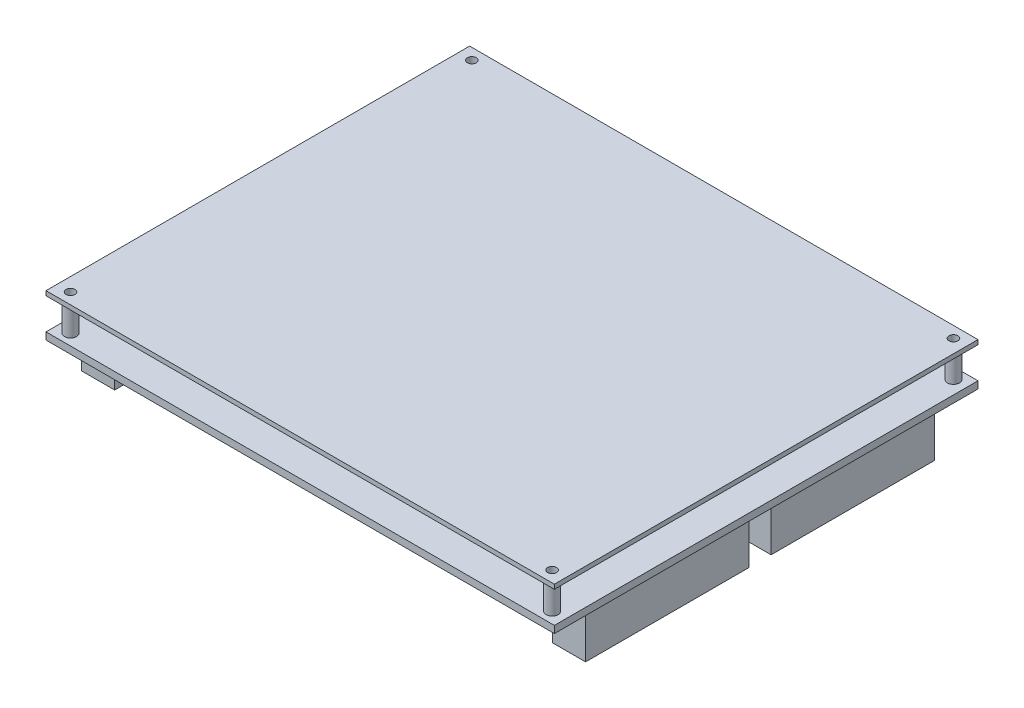
ISO-10303-21;
HEADER;
FILE_DESCRIPTION(('STEP AP214'),'2;1');
FILE_NAME('part.step','',(''),(''),'','','');
FILE_SCHEMA(('AUTOMOTIVE_DESIGN { 1 0 10303 214 1 1 1 1 }'));
ENDSEC;
DATA;
#1=APPLICATION_CONTEXT('core data for automotive mechanical design processes');
#2=APPLICATION_PROTOCOL_DEFINITION('international standard','automotive_design',2000,#1);
#3=PRODUCT_CONTEXT('',#1,'mechanical');
#4=PRODUCT('Part','Part','',(#3));
#5=PRODUCT_RELATED_PRODUCT_CATEGORY('part','',(#4));
#6=PRODUCT_DEFINITION_FORMATION('','',#4);
#7=PRODUCT_DEFINITION_CONTEXT('part definition',#1,'design');
#8=PRODUCT_DEFINITION('design','',#6,#7);
#9=PRODUCT_DEFINITION_SHAPE('','',#8);
#10=(LENGTH_UNIT() NAMED_UNIT(*) SI_UNIT(.MILLI.,.METRE.));
#11=(NAMED_UNIT(*) PLANE_ANGLE_UNIT() SI_UNIT($,.RADIAN.));
#12=(NAMED_UNIT(*) SI_UNIT($,.STERADIAN.) SOLID_ANGLE_UNIT());
#13=UNCERTAINTY_MEASURE_WITH_UNIT(LENGTH_MEASURE(1.E-05),#10,'distance_accuracy_value','');
#14=(GEOMETRIC_REPRESENTATION_CONTEXT(3) GLOBAL_UNCERTAINTY_ASSIGNED_CONTEXT((#13)) GLOBAL_UNIT_ASSIGNED_CONTEXT((#10,
#11,#12)) REPRESENTATION_CONTEXT('',''));
#15=CARTESIAN_POINT('',(0.,0.,0.));
#16=DIRECTION('',(0.,0.,1.));
#17=DIRECTION('',(1.,0.,0.));
#18=AXIS2_PLACEMENT_3D('',#15,#16,#17);
#19=CARTESIAN_POINT('',(-57.,1.6,47.5));
#20=DIRECTION('',(0.,1.,0.));
#21=DIRECTION('',(0.,0.,1.));
#22=AXIS2_PLACEMENT_3D('',#19,#20,#21);
#23=PLANE('',#22);
#24=CARTESIAN_POINT('',(54.,1.6,45.));
#25=DIRECTION('',(0.,1.,0.));
#26=DIRECTION('',(0.,0.,1.));
#27=AXIS2_PLACEMENT_3D('',#24,#25,#26);
#28=CIRCLE('',#27,1.35);
#29=CARTESIAN_POINT('',(54.,1.6,46.35));
#30=VERTEX_POINT('',#29);
#31=EDGE_CURVE('E246',#30,#30,#28,.T.);
#32=ORIENTED_EDGE('',*,*,#31,.F.);
#33=EDGE_LOOP('',(#32));
#34=FACE_BOUND('',#33,.T.);
#35=CARTESIAN_POINT('',(-54.,1.6,-45.));
#36=DIRECTION('',(0.,1.,0.));
#37=DIRECTION('',(0.,0.,1.));
#38=AXIS2_PLACEMENT_3D('',#35,#36,#37);
#39=CIRCLE('',#38,1.35);
#40=CARTESIAN_POINT('',(-54.,1.6,-43.65));
#41=VERTEX_POINT('',#40);
#42=EDGE_CURVE('E258',#41,#41,#39,.T.);
#43=ORIENTED_EDGE('',*,*,#42,.F.);
#44=EDGE_LOOP('',(#43));
#45=FACE_BOUND('',#44,.T.);
#46=DIRECTION('',(0.,0.,1.));
#47=VECTOR('',#46,1.);
#48=CARTESIAN_POINT('',(-57.,1.6,-47.5));
#49=LINE('',#48,#47);
#50=CARTESIAN_POINT('',(-57.,1.6,-47.5));
#51=VERTEX_POINT('',#50);
#52=CARTESIAN_POINT('',(-57.,1.6,47.5));
#53=VERTEX_POINT('',#52);
#54=EDGE_CURVE('E400',#51,#53,#49,.T.);
#55=ORIENTED_EDGE('',*,*,#54,.T.);
#56=DIRECTION('',(1.,0.,0.));
#57=VECTOR('',#56,1.);
#58=CARTESIAN_POINT('',(-57.,1.6,47.5));
#59=LINE('',#58,#57);
#60=CARTESIAN_POINT('',(57.,1.6,47.5));
#61=VERTEX_POINT('',#60);
#62=EDGE_CURVE('E403',#53,#61,#59,.T.);
#63=ORIENTED_EDGE('',*,*,#62,.T.);
#64=DIRECTION('',(0.,0.,-1.));
#65=VECTOR('',#64,1.);
#66=CARTESIAN_POINT('',(57.,1.6,-47.5));
#67=LINE('',#66,#65);
#68=CARTESIAN_POINT('',(57.,1.6,-47.5));
#69=VERTEX_POINT('',#68);
#70=EDGE_CURVE('E405',#61,#69,#67,.T.);
#71=ORIENTED_EDGE('',*,*,#70,.T.);
#72=DIRECTION('',(-1.,0.,0.));
#73=VECTOR('',#72,1.);
#74=CARTESIAN_POINT('',(-57.,1.6,-47.5));
#75=LINE('',#74,#73);
#76=EDGE_CURVE('E407',#69,#51,#75,.T.);
#77=ORIENTED_EDGE('',*,*,#76,.T.);
#78=EDGE_LOOP('',(#55,#63,#71,#77));
#79=FACE_BOUND('',#78,.T.);
#80=CARTESIAN_POINT('',(-54.,1.6,45.));
#81=DIRECTION('',(0.,1.,0.));
#82=DIRECTION('',(0.,0.,1.));
#83=AXIS2_PLACEMENT_3D('',#80,#81,#82);
#84=CIRCLE('',#83,1.35000000000001);
#85=CARTESIAN_POINT('',(-54.,1.6,46.35));
#86=VERTEX_POINT('',#85);
#87=EDGE_CURVE('E252',#86,#86,#84,.T.);
#88=ORIENTED_EDGE('',*,*,#87,.F.);
#89=EDGE_LOOP('',(#88));
#90=FACE_BOUND('',#89,.T.);
#91=CARTESIAN_POINT('',(54.,1.6,-45.));
#92=DIRECTION('',(0.,1.,0.));
#93=DIRECTION('',(0.,0.,1.));
#94=AXIS2_PLACEMENT_3D('',#91,#92,#93);
#95=CIRCLE('',#94,1.35000000000001);
#96=CARTESIAN_POINT('',(54.,1.6,-43.65));
#97=VERTEX_POINT('',#96);
#98=EDGE_CURVE('E212',#97,#97,#95,.T.);
#99=ORIENTED_EDGE('',*,*,#98,.F.);
#100=EDGE_LOOP('',(#99));
#101=FACE_BOUND('',#100,.T.);
#102=ADVANCED_FACE('F34',(#34,#45,#79,#90,#101),#23,.T.);
#103=CARTESIAN_POINT('',(-57.,0.,47.5));
#104=DIRECTION('',(0.,1.,0.));
#105=DIRECTION('',(0.,0.,1.));
#106=AXIS2_PLACEMENT_3D('',#103,#104,#105);
#107=PLANE('',#106);
#108=CARTESIAN_POINT('',(54.,0.,-45.));
#109=DIRECTION('',(0.,1.,0.));
#110=DIRECTION('',(0.,0.,1.));
#111=AXIS2_PLACEMENT_3D('',#108,#109,#110);
#112=CIRCLE('',#111,0.999999999999998);
#113=CARTESIAN_POINT('',(54.,0.,-44.));
#114=VERTEX_POINT('',#113);
#115=EDGE_CURVE('E598',#114,#114,#112,.T.);
#116=ORIENTED_EDGE('',*,*,#115,.T.);
#117=EDGE_LOOP('',(#116));
#118=FACE_BOUND('',#117,.T.);
#119=CARTESIAN_POINT('',(54.,0.,45.));
#120=DIRECTION('',(0.,1.,0.));
#121=DIRECTION('',(0.,0.,1.));
#122=AXIS2_PLACEMENT_3D('',#119,#120,#121);
#123=CIRCLE('',#122,0.999999999999998);
#124=CARTESIAN_POINT('',(54.,0.,46.));
#125=VERTEX_POINT('',#124);
#126=EDGE_CURVE('E602',#125,#125,#123,.T.);
#127=ORIENTED_EDGE('',*,*,#126,.T.);
#128=EDGE_LOOP('',(#127));
#129=FACE_BOUND('',#128,.T.);
#130=CARTESIAN_POINT('',(-54.,0.,45.));
#131=DIRECTION('',(0.,1.,0.));
#132=DIRECTION('',(0.,0.,1.));
#133=AXIS2_PLACEMENT_3D('',#130,#131,#132);
#134=CIRCLE('',#133,0.999999999999998);
#135=CARTESIAN_POINT('',(-54.,0.,46.));
#136=VERTEX_POINT('',#135);
#137=EDGE_CURVE('E611',#136,#136,#134,.T.);
#138=ORIENTED_EDGE('',*,*,#137,.T.);
#139=EDGE_LOOP('',(#138));
#140=FACE_BOUND('',#139,.T.);
#141=CARTESIAN_POINT('',(-54.,0.,-45.));
#142=DIRECTION('',(0.,1.,0.));
#143=DIRECTION('',(0.,0.,1.));
#144=AXIS2_PLACEMENT_3D('',#141,#142,#143);
#145=CIRCLE('',#144,0.999999999999998);
#146=CARTESIAN_POINT('',(-54.,0.,-44.));
#147=VERTEX_POINT('',#146);
#148=EDGE_CURVE('E219',#147,#147,#145,.T.);
#149=ORIENTED_EDGE('',*,*,#148,.T.);
#150=EDGE_LOOP('',(#149));
#151=FACE_BOUND('',#150,.T.);
#152=DIRECTION('',(0.,0.,-1.));
#153=VECTOR('',#152,1.);
#154=CARTESIAN_POINT('',(49.1,0.,40.));
#155=LINE('',#154,#153);
#156=CARTESIAN_POINT('',(49.1,0.,40.));
#157=VERTEX_POINT('',#156);
#158=CARTESIAN_POINT('',(49.1,0.,3.4));
#159=VERTEX_POINT('',#158);
#160=EDGE_CURVE('E292',#157,#159,#155,.T.);
#161=ORIENTED_EDGE('',*,*,#160,.F.);
#162=DIRECTION('',(-1.,0.,0.));
#163=VECTOR('',#162,1.);
#164=CARTESIAN_POINT('',(49.1,0.,40.));
#165=LINE('',#164,#163);
#166=CARTESIAN_POINT('',(56.5,0.,40.));
#167=VERTEX_POINT('',#166);
#168=EDGE_CURVE('E301',#167,#157,#165,.T.);
#169=ORIENTED_EDGE('',*,*,#168,.F.);
#170=DIRECTION('',(0.,0.,1.));
#171=VECTOR('',#170,1.);
#172=CARTESIAN_POINT('',(56.5,0.,40.));
#173=LINE('',#172,#171);
#174=CARTESIAN_POINT('',(56.5,0.,3.4));
#175=VERTEX_POINT('',#174);
#176=EDGE_CURVE('E298',#175,#167,#173,.T.);
#177=ORIENTED_EDGE('',*,*,#176,.F.);
#178=DIRECTION('',(1.,0.,0.));
#179=VECTOR('',#178,1.);
#180=CARTESIAN_POINT('',(49.1,0.,3.4));
#181=LINE('',#180,#179);
#182=EDGE_CURVE('E295',#159,#175,#181,.T.);
#183=ORIENTED_EDGE('',*,*,#182,.F.);
#184=EDGE_LOOP('',(#161,#169,#177,#183));
#185=FACE_BOUND('',#184,.T.);
#186=DIRECTION('',(0.,0.,-1.));
#187=VECTOR('',#186,1.);
#188=CARTESIAN_POINT('',(-56.5,0.,40.));
#189=LINE('',#188,#187);
#190=CARTESIAN_POINT('',(-56.5,0.,40.));
#191=VERTEX_POINT('',#190);
#192=CARTESIAN_POINT('',(-56.5,0.,3.4));
#193=VERTEX_POINT('',#192);
#194=EDGE_CURVE('E358',#191,#193,#189,.T.);
#195=ORIENTED_EDGE('',*,*,#194,.F.);
#196=DIRECTION('',(-1.,0.,0.));
#197=VECTOR('',#196,1.);
#198=CARTESIAN_POINT('',(-56.5,0.,40.));
#199=LINE('',#198,#197);
#200=CARTESIAN_POINT('',(-49.1,0.,40.));
#201=VERTEX_POINT('',#200);
#202=EDGE_CURVE('E367',#201,#191,#199,.T.);
#203=ORIENTED_EDGE('',*,*,#202,.F.);
#204=DIRECTION('',(0.,0.,1.));
#205=VECTOR('',#204,1.);
#206=CARTESIAN_POINT('',(-49.1,0.,40.));
#207=LINE('',#206,#205);
#208=CARTESIAN_POINT('',(-49.1,0.,3.4));
#209=VERTEX_POINT('',#208);
#210=EDGE_CURVE('E364',#209,#201,#207,.T.);
#211=ORIENTED_EDGE('',*,*,#210,.F.);
#212=DIRECTION('',(1.,0.,0.));
#213=VECTOR('',#212,1.);
#214=CARTESIAN_POINT('',(-56.5,0.,3.4));
#215=LINE('',#214,#213);
#216=EDGE_CURVE('E361',#193,#209,#215,.T.);
#217=ORIENTED_EDGE('',*,*,#216,.F.);
#218=EDGE_LOOP('',(#195,#203,#211,#217));
#219=FACE_BOUND('',#218,.T.);
#220=DIRECTION('',(0.,0.,1.));
#221=VECTOR('',#220,1.);
#222=CARTESIAN_POINT('',(-57.,0.,-47.5));
#223=LINE('',#222,#221);
#224=CARTESIAN_POINT('',(-57.,0.,-47.5));
#225=VERTEX_POINT('',#224);
#226=CARTESIAN_POINT('',(-57.,0.,47.5));
#227=VERTEX_POINT('',#226);
#228=EDGE_CURVE('E391',#225,#227,#223,.T.);
#229=ORIENTED_EDGE('',*,*,#228,.F.);
#230=DIRECTION('',(-1.,0.,0.));
#231=VECTOR('',#230,1.);
#232=CARTESIAN_POINT('',(-57.,0.,-47.5));
#233=LINE('',#232,#231);
#234=CARTESIAN_POINT('',(57.,0.,-47.5));
#235=VERTEX_POINT('',#234);
#236=EDGE_CURVE('E398',#235,#225,#233,.T.);
#237=ORIENTED_EDGE('',*,*,#236,.F.);
#238=DIRECTION('',(0.,0.,-1.));
#239=VECTOR('',#238,1.);
#240=CARTESIAN_POINT('',(57.,0.,-47.5));
#241=LINE('',#240,#239);
#242=CARTESIAN_POINT('',(57.,0.,47.5));
#243=VERTEX_POINT('',#242);
#244=EDGE_CURVE('E396',#243,#235,#241,.T.);
#245=ORIENTED_EDGE('',*,*,#244,.F.);
#246=DIRECTION('',(1.,0.,0.));
#247=VECTOR('',#246,1.);
#248=CARTESIAN_POINT('',(-57.,0.,47.5));
#249=LINE('',#248,#247);
#250=EDGE_CURVE('E394',#227,#243,#249,.T.);
#251=ORIENTED_EDGE('',*,*,#250,.F.);
#252=EDGE_LOOP('',(#229,#237,#245,#251));
#253=FACE_BOUND('',#252,.T.);
#254=DIRECTION('',(0.,0.,-1.));
#255=VECTOR('',#254,1.);
#256=CARTESIAN_POINT('',(-56.5,0.,-5.8));
#257=LINE('',#256,#255);
#258=CARTESIAN_POINT('',(-56.5,0.,-5.8));
#259=VERTEX_POINT('',#258);
#260=CARTESIAN_POINT('',(-56.5,0.,-42.4));
#261=VERTEX_POINT('',#260);
#262=EDGE_CURVE('E325',#259,#261,#257,.T.);
#263=ORIENTED_EDGE('',*,*,#262,.F.);
#264=DIRECTION('',(-1.,0.,0.));
#265=VECTOR('',#264,1.);
#266=CARTESIAN_POINT('',(-56.5,0.,-5.8));
#267=LINE('',#266,#265);
#268=CARTESIAN_POINT('',(-49.1,0.,-5.8));
#269=VERTEX_POINT('',#268);
#270=EDGE_CURVE('E334',#269,#259,#267,.T.);
#271=ORIENTED_EDGE('',*,*,#270,.F.);
#272=DIRECTION('',(0.,0.,1.));
#273=VECTOR('',#272,1.);
#274=CARTESIAN_POINT('',(-49.1,0.,-5.8));
#275=LINE('',#274,#273);
#276=CARTESIAN_POINT('',(-49.1,0.,-42.4));
#277=VERTEX_POINT('',#276);
#278=EDGE_CURVE('E331',#277,#269,#275,.T.);
#279=ORIENTED_EDGE('',*,*,#278,.F.);
#280=DIRECTION('',(1.,0.,0.));
#281=VECTOR('',#280,1.);
#282=CARTESIAN_POINT('',(-56.5,0.,-42.4));
#283=LINE('',#282,#281);
#284=EDGE_CURVE('E328',#261,#277,#283,.T.);
#285=ORIENTED_EDGE('',*,*,#284,.F.);
#286=EDGE_LOOP('',(#263,#271,#279,#285));
#287=FACE_BOUND('',#286,.T.);
#288=DIRECTION('',(0.,0.,-1.));
#289=VECTOR('',#288,1.);
#290=CARTESIAN_POINT('',(49.1,0.,-1.6));
#291=LINE('',#290,#289);
#292=CARTESIAN_POINT('',(49.1,0.,-1.6));
#293=VERTEX_POINT('',#292);
#294=CARTESIAN_POINT('',(49.1,0.,-38.2));
#295=VERTEX_POINT('',#294);
#296=EDGE_CURVE('E264',#293,#295,#291,.T.);
#297=ORIENTED_EDGE('',*,*,#296,.F.);
#298=DIRECTION('',(-1.,0.,0.));
#299=VECTOR('',#298,1.);
#300=CARTESIAN_POINT('',(49.1,0.,-1.6));
#301=LINE('',#300,#299);
#302=CARTESIAN_POINT('',(56.5,0.,-1.6));
#303=VERTEX_POINT('',#302);
#304=EDGE_CURVE('E269',#303,#293,#301,.T.);
#305=ORIENTED_EDGE('',*,*,#304,.F.);
#306=DIRECTION('',(0.,0.,1.));
#307=VECTOR('',#306,1.);
#308=CARTESIAN_POINT('',(56.5,0.,-1.6));
#309=LINE('',#308,#307);
#310=CARTESIAN_POINT('',(56.5,0.,-38.2));
#311=VERTEX_POINT('',#310);
#312=EDGE_CURVE('E54',#311,#303,#309,.T.);
#313=ORIENTED_EDGE('',*,*,#312,.F.);
#314=DIRECTION('',(1.,0.,0.));
#315=VECTOR('',#314,1.);
#316=CARTESIAN_POINT('',(49.1,0.,-38.2));
#317=LINE('',#316,#315);
#318=EDGE_CURVE('E49',#295,#311,#317,.T.);
#319=ORIENTED_EDGE('',*,*,#318,.F.);
#320=EDGE_LOOP('',(#297,#305,#313,#319));
#321=FACE_BOUND('',#320,.T.);
#322=ADVANCED_FACE('F425',(#118,#129,#140,#151,#185,#219,#253,#287,#321),#107,.F.);
#323=CARTESIAN_POINT('',(-57.,1.6,-47.5));
#324=DIRECTION('',(1.,0.,0.));
#325=DIRECTION('',(0.,0.,-1.));
#326=AXIS2_PLACEMENT_3D('',#323,#324,#325);
#327=PLANE('',#326);
#328=ORIENTED_EDGE('',*,*,#228,.T.);
#329=DIRECTION('',(0.,-1.,0.));
#330=VECTOR('',#329,1.);
#331=CARTESIAN_POINT('',(-57.,1.6,47.5));
#332=LINE('',#331,#330);
#333=EDGE_CURVE('E11',#53,#227,#332,.T.);
#334=ORIENTED_EDGE('',*,*,#333,.F.);
#335=ORIENTED_EDGE('',*,*,#54,.F.);
#336=DIRECTION('',(0.,-1.,0.));
#337=VECTOR('',#336,1.);
#338=CARTESIAN_POINT('',(-57.,1.6,-47.5));
#339=LINE('',#338,#337);
#340=EDGE_CURVE('E409',#51,#225,#339,.T.);
#341=ORIENTED_EDGE('',*,*,#340,.T.);
#342=EDGE_LOOP('',(#328,#334,#335,#341));
#343=FACE_BOUND('',#342,.T.);
#344=ADVANCED_FACE('F36',(#343),#327,.F.);
#345=CARTESIAN_POINT('',(-57.,1.6,47.5));
#346=DIRECTION('',(0.,0.,-1.));
#347=DIRECTION('',(-1.,0.,0.));
#348=AXIS2_PLACEMENT_3D('',#345,#346,#347);
#349=PLANE('',#348);
#350=ORIENTED_EDGE('',*,*,#250,.T.);
#351=DIRECTION('',(0.,-1.,0.));
#352=VECTOR('',#351,1.);
#353=CARTESIAN_POINT('',(57.,1.6,47.5));
#354=LINE('',#353,#352);
#355=EDGE_CURVE('E42',#61,#243,#354,.T.);
#356=ORIENTED_EDGE('',*,*,#355,.F.);
#357=ORIENTED_EDGE('',*,*,#62,.F.);
#358=ORIENTED_EDGE('',*,*,#333,.T.);
#359=EDGE_LOOP('',(#350,#356,#357,#358));
#360=FACE_BOUND('',#359,.T.);
#361=ADVANCED_FACE('F436',(#360),#349,.F.);
#362=CARTESIAN_POINT('',(57.,1.6,-47.5));
#363=DIRECTION('',(-1.,0.,0.));
#364=DIRECTION('',(0.,0.,1.));
#365=AXIS2_PLACEMENT_3D('',#362,#363,#364);
#366=PLANE('',#365);
#367=ORIENTED_EDGE('',*,*,#244,.T.);
#368=DIRECTION('',(0.,-1.,0.));
#369=VECTOR('',#368,1.);
#370=CARTESIAN_POINT('',(57.,1.6,-47.5));
#371=LINE('',#370,#369);
#372=EDGE_CURVE('E412',#69,#235,#371,.T.);
#373=ORIENTED_EDGE('',*,*,#372,.F.);
#374=ORIENTED_EDGE('',*,*,#70,.F.);
#375=ORIENTED_EDGE('',*,*,#355,.T.);
#376=EDGE_LOOP('',(#367,#373,#374,#375));
#377=FACE_BOUND('',#376,.T.);
#378=ADVANCED_FACE('F419',(#377),#366,.F.);
#379=CARTESIAN_POINT('',(-57.,1.6,-47.5));
#380=DIRECTION('',(0.,0.,1.));
#381=DIRECTION('',(1.,0.,0.));
#382=AXIS2_PLACEMENT_3D('',#379,#380,#381);
#383=PLANE('',#382);
#384=ORIENTED_EDGE('',*,*,#236,.T.);
#385=ORIENTED_EDGE('',*,*,#340,.F.);
#386=ORIENTED_EDGE('',*,*,#76,.F.);
#387=ORIENTED_EDGE('',*,*,#372,.T.);
#388=EDGE_LOOP('',(#384,#385,#386,#387));
#389=FACE_BOUND('',#388,.T.);
#390=ADVANCED_FACE('F429',(#389),#383,.F.);
#391=CARTESIAN_POINT('',(-56.5,-9.5,40.));
#392=DIRECTION('',(1.,0.,0.));
#393=DIRECTION('',(0.,0.,-1.));
#394=AXIS2_PLACEMENT_3D('',#391,#392,#393);
#395=PLANE('',#394);
#396=ORIENTED_EDGE('',*,*,#194,.T.);
#397=DIRECTION('',(0.,1.,0.));
#398=VECTOR('',#397,1.);
#399=CARTESIAN_POINT('',(-56.5,-9.5,3.4));
#400=LINE('',#399,#398);
#401=CARTESIAN_POINT('',(-56.5,-9.5,3.4));
#402=VERTEX_POINT('',#401);
#403=EDGE_CURVE('E388',#402,#193,#400,.T.);
#404=ORIENTED_EDGE('',*,*,#403,.F.);
#405=DIRECTION('',(0.,0.,-1.));
#406=VECTOR('',#405,1.);
#407=CARTESIAN_POINT('',(-56.5,-9.5,40.));
#408=LINE('',#407,#406);
#409=CARTESIAN_POINT('',(-56.5,-9.5,40.));
#410=VERTEX_POINT('',#409);
#411=EDGE_CURVE('E370',#410,#402,#408,.T.);
#412=ORIENTED_EDGE('',*,*,#411,.F.);
#413=DIRECTION('',(0.,1.,0.));
#414=VECTOR('',#413,1.);
#415=CARTESIAN_POINT('',(-56.5,-9.5,40.));
#416=LINE('',#415,#414);
#417=EDGE_CURVE('E379',#410,#191,#416,.T.);
#418=ORIENTED_EDGE('',*,*,#417,.T.);
#419=EDGE_LOOP('',(#396,#404,#412,#418));
#420=FACE_BOUND('',#419,.T.);
#421=ADVANCED_FACE('F456',(#420),#395,.F.);
#422=CARTESIAN_POINT('',(-56.5,-9.5,3.4));
#423=DIRECTION('',(0.,0.,1.));
#424=DIRECTION('',(1.,0.,0.));
#425=AXIS2_PLACEMENT_3D('',#422,#423,#424);
#426=PLANE('',#425);
#427=ORIENTED_EDGE('',*,*,#216,.T.);
#428=DIRECTION('',(0.,1.,0.));
#429=VECTOR('',#428,1.);
#430=CARTESIAN_POINT('',(-49.1,-9.5,3.4));
#431=LINE('',#430,#429);
#432=CARTESIAN_POINT('',(-49.1,-9.5,3.4));
#433=VERTEX_POINT('',#432);
#434=EDGE_CURVE('E385',#433,#209,#431,.T.);
#435=ORIENTED_EDGE('',*,*,#434,.F.);
#436=DIRECTION('',(1.,0.,0.));
#437=VECTOR('',#436,1.);
#438=CARTESIAN_POINT('',(-56.5,-9.5,3.4));
#439=LINE('',#438,#437);
#440=EDGE_CURVE('E373',#402,#433,#439,.T.);
#441=ORIENTED_EDGE('',*,*,#440,.F.);
#442=ORIENTED_EDGE('',*,*,#403,.T.);
#443=EDGE_LOOP('',(#427,#435,#441,#442));
#444=FACE_BOUND('',#443,.T.);
#445=ADVANCED_FACE('F460',(#444),#426,.F.);
#446=CARTESIAN_POINT('',(-49.1,-9.5,40.));
#447=DIRECTION('',(-1.,0.,0.));
#448=DIRECTION('',(0.,0.,1.));
#449=AXIS2_PLACEMENT_3D('',#446,#447,#448);
#450=PLANE('',#449);
#451=ORIENTED_EDGE('',*,*,#210,.T.);
#452=DIRECTION('',(0.,1.,0.));
#453=VECTOR('',#452,1.);
#454=CARTESIAN_POINT('',(-49.1,-9.5,40.));
#455=LINE('',#454,#453);
#456=CARTESIAN_POINT('',(-49.1,-9.5,40.));
#457=VERTEX_POINT('',#456);
#458=EDGE_CURVE('E382',#457,#201,#455,.T.);
#459=ORIENTED_EDGE('',*,*,#458,.F.);
#460=DIRECTION('',(0.,0.,1.));
#461=VECTOR('',#460,1.);
#462=CARTESIAN_POINT('',(-49.1,-9.5,40.));
#463=LINE('',#462,#461);
#464=EDGE_CURVE('E375',#433,#457,#463,.T.);
#465=ORIENTED_EDGE('',*,*,#464,.F.);
#466=ORIENTED_EDGE('',*,*,#434,.T.);
#467=EDGE_LOOP('',(#451,#459,#465,#466));
#468=FACE_BOUND('',#467,.T.);
#469=ADVANCED_FACE('F465',(#468),#450,.F.);
#470=CARTESIAN_POINT('',(-56.5,-9.5,40.));
#471=DIRECTION('',(0.,0.,-1.));
#472=DIRECTION('',(-1.,0.,0.));
#473=AXIS2_PLACEMENT_3D('',#470,#471,#472);
#474=PLANE('',#473);
#475=ORIENTED_EDGE('',*,*,#202,.T.);
#476=ORIENTED_EDGE('',*,*,#417,.F.);
#477=DIRECTION('',(-1.,0.,0.));
#478=VECTOR('',#477,1.);
#479=CARTESIAN_POINT('',(-56.5,-9.5,40.));
#480=LINE('',#479,#478);
#481=EDGE_CURVE('E377',#457,#410,#480,.T.);
#482=ORIENTED_EDGE('',*,*,#481,.F.);
#483=ORIENTED_EDGE('',*,*,#458,.T.);
#484=EDGE_LOOP('',(#475,#476,#482,#483));
#485=FACE_BOUND('',#484,.T.);
#486=ADVANCED_FACE('F471',(#485),#474,.F.);
#487=CARTESIAN_POINT('',(-56.5,-9.5,3.4));
#488=DIRECTION('',(0.,-1.,0.));
#489=DIRECTION('',(0.,0.,-1.));
#490=AXIS2_PLACEMENT_3D('',#487,#488,#489);
#491=PLANE('',#490);
#492=ORIENTED_EDGE('',*,*,#411,.T.);
#493=ORIENTED_EDGE('',*,*,#440,.T.);
#494=ORIENTED_EDGE('',*,*,#464,.T.);
#495=ORIENTED_EDGE('',*,*,#481,.T.);
#496=EDGE_LOOP('',(#492,#493,#494,#495));
#497=FACE_BOUND('',#496,.T.);
#498=ADVANCED_FACE('F475',(#497),#491,.T.);
#499=CARTESIAN_POINT('',(-56.5,-9.5,-5.8));
#500=DIRECTION('',(1.,0.,0.));
#501=DIRECTION('',(0.,0.,-1.));
#502=AXIS2_PLACEMENT_3D('',#499,#500,#501);
#503=PLANE('',#502);
#504=ORIENTED_EDGE('',*,*,#262,.T.);
#505=DIRECTION('',(0.,1.,0.));
#506=VECTOR('',#505,1.);
#507=CARTESIAN_POINT('',(-56.5,-9.5,-42.4));
#508=LINE('',#507,#506);
#509=CARTESIAN_POINT('',(-56.5,-9.5,-42.4));
#510=VERTEX_POINT('',#509);
#511=EDGE_CURVE('E355',#510,#261,#508,.T.);
#512=ORIENTED_EDGE('',*,*,#511,.F.);
#513=DIRECTION('',(0.,0.,-1.));
#514=VECTOR('',#513,1.);
#515=CARTESIAN_POINT('',(-56.5,-9.5,-5.8));
#516=LINE('',#515,#514);
#517=CARTESIAN_POINT('',(-56.5,-9.5,-5.8));
#518=VERTEX_POINT('',#517);
#519=EDGE_CURVE('E337',#518,#510,#516,.T.);
#520=ORIENTED_EDGE('',*,*,#519,.F.);
#521=DIRECTION('',(0.,1.,0.));
#522=VECTOR('',#521,1.);
#523=CARTESIAN_POINT('',(-56.5,-9.5,-5.8));
#524=LINE('',#523,#522);
#525=EDGE_CURVE('E346',#518,#259,#524,.T.);
#526=ORIENTED_EDGE('',*,*,#525,.T.);
#527=EDGE_LOOP('',(#504,#512,#520,#526));
#528=FACE_BOUND('',#527,.T.);
#529=ADVANCED_FACE('F479',(#528),#503,.F.);
#530=CARTESIAN_POINT('',(-56.5,-9.5,-42.4));
#531=DIRECTION('',(0.,0.,1.));
#532=DIRECTION('',(1.,0.,0.));
#533=AXIS2_PLACEMENT_3D('',#530,#531,#532);
#534=PLANE('',#533);
#535=ORIENTED_EDGE('',*,*,#284,.T.);
#536=DIRECTION('',(0.,1.,0.));
#537=VECTOR('',#536,1.);
#538=CARTESIAN_POINT('',(-49.1,-9.5,-42.4));
#539=LINE('',#538,#537);
#540=CARTESIAN_POINT('',(-49.1,-9.5,-42.4));
#541=VERTEX_POINT('',#540);
#542=EDGE_CURVE('E352',#541,#277,#539,.T.);
#543=ORIENTED_EDGE('',*,*,#542,.F.);
#544=DIRECTION('',(1.,0.,0.));
#545=VECTOR('',#544,1.);
#546=CARTESIAN_POINT('',(-56.5,-9.5,-42.4));
#547=LINE('',#546,#545);
#548=EDGE_CURVE('E340',#510,#541,#547,.T.);
#549=ORIENTED_EDGE('',*,*,#548,.F.);
#550=ORIENTED_EDGE('',*,*,#511,.T.);
#551=EDGE_LOOP('',(#535,#543,#549,#550));
#552=FACE_BOUND('',#551,.T.);
#553=ADVANCED_FACE('F483',(#552),#534,.F.);
#554=CARTESIAN_POINT('',(-49.1,-9.5,-5.8));
#555=DIRECTION('',(-1.,0.,0.));
#556=DIRECTION('',(0.,0.,1.));
#557=AXIS2_PLACEMENT_3D('',#554,#555,#556);
#558=PLANE('',#557);
#559=ORIENTED_EDGE('',*,*,#278,.T.);
#560=DIRECTION('',(0.,1.,0.));
#561=VECTOR('',#560,1.);
#562=CARTESIAN_POINT('',(-49.1,-9.5,-5.8));
#563=LINE('',#562,#561);
#564=CARTESIAN_POINT('',(-49.1,-9.5,-5.8));
#565=VERTEX_POINT('',#564);
#566=EDGE_CURVE('E349',#565,#269,#563,.T.);
#567=ORIENTED_EDGE('',*,*,#566,.F.);
#568=DIRECTION('',(0.,0.,1.));
#569=VECTOR('',#568,1.);
#570=CARTESIAN_POINT('',(-49.1,-9.5,-5.8));
#571=LINE('',#570,#569);
#572=EDGE_CURVE('E342',#541,#565,#571,.T.);
#573=ORIENTED_EDGE('',*,*,#572,.F.);
#574=ORIENTED_EDGE('',*,*,#542,.T.);
#575=EDGE_LOOP('',(#559,#567,#573,#574));
#576=FACE_BOUND('',#575,.T.);
#577=ADVANCED_FACE('F487',(#576),#558,.F.);
#578=CARTESIAN_POINT('',(-56.5,-9.5,-5.8));
#579=DIRECTION('',(0.,0.,-1.));
#580=DIRECTION('',(-1.,0.,0.));
#581=AXIS2_PLACEMENT_3D('',#578,#579,#580);
#582=PLANE('',#581);
#583=ORIENTED_EDGE('',*,*,#270,.T.);
#584=ORIENTED_EDGE('',*,*,#525,.F.);
#585=DIRECTION('',(-1.,0.,0.));
#586=VECTOR('',#585,1.);
#587=CARTESIAN_POINT('',(-56.5,-9.5,-5.8));
#588=LINE('',#587,#586);
#589=EDGE_CURVE('E344',#565,#518,#588,.T.);
#590=ORIENTED_EDGE('',*,*,#589,.F.);
#591=ORIENTED_EDGE('',*,*,#566,.T.);
#592=EDGE_LOOP('',(#583,#584,#590,#591));
#593=FACE_BOUND('',#592,.T.);
#594=ADVANCED_FACE('F491',(#593),#582,.F.);
#595=CARTESIAN_POINT('',(-56.5,-9.5,-42.4));
#596=DIRECTION('',(0.,-1.,0.));
#597=DIRECTION('',(0.,0.,-1.));
#598=AXIS2_PLACEMENT_3D('',#595,#596,#597);
#599=PLANE('',#598);
#600=ORIENTED_EDGE('',*,*,#519,.T.);
#601=ORIENTED_EDGE('',*,*,#548,.T.);
#602=ORIENTED_EDGE('',*,*,#572,.T.);
#603=ORIENTED_EDGE('',*,*,#589,.T.);
#604=EDGE_LOOP('',(#600,#601,#602,#603));
#605=FACE_BOUND('',#604,.T.);
#606=ADVANCED_FACE('F495',(#605),#599,.T.);
#607=CARTESIAN_POINT('',(49.1,-9.5,40.));
#608=DIRECTION('',(1.,0.,0.));
#609=DIRECTION('',(0.,0.,-1.));
#610=AXIS2_PLACEMENT_3D('',#607,#608,#609);
#611=PLANE('',#610);
#612=ORIENTED_EDGE('',*,*,#160,.T.);
#613=DIRECTION('',(0.,1.,0.));
#614=VECTOR('',#613,1.);
#615=CARTESIAN_POINT('',(49.1,-9.5,3.4));
#616=LINE('',#615,#614);
#617=CARTESIAN_POINT('',(49.1,-9.5,3.4));
#618=VERTEX_POINT('',#617);
#619=EDGE_CURVE('E322',#618,#159,#616,.T.);
#620=ORIENTED_EDGE('',*,*,#619,.F.);
#621=DIRECTION('',(0.,0.,-1.));
#622=VECTOR('',#621,1.);
#623=CARTESIAN_POINT('',(49.1,-9.5,40.));
#624=LINE('',#623,#622);
#625=CARTESIAN_POINT('',(49.1,-9.5,40.));
#626=VERTEX_POINT('',#625);
#627=EDGE_CURVE('E304',#626,#618,#624,.T.);
#628=ORIENTED_EDGE('',*,*,#627,.F.);
#629=DIRECTION('',(0.,1.,0.));
#630=VECTOR('',#629,1.);
#631=CARTESIAN_POINT('',(49.1,-9.5,40.));
#632=LINE('',#631,#630);
#633=EDGE_CURVE('E313',#626,#157,#632,.T.);
#634=ORIENTED_EDGE('',*,*,#633,.T.);
#635=EDGE_LOOP('',(#612,#620,#628,#634));
#636=FACE_BOUND('',#635,.T.);
#637=ADVANCED_FACE('F499',(#636),#611,.F.);
#638=CARTESIAN_POINT('',(49.1,-9.5,3.4));
#639=DIRECTION('',(0.,0.,1.));
#640=DIRECTION('',(1.,0.,0.));
#641=AXIS2_PLACEMENT_3D('',#638,#639,#640);
#642=PLANE('',#641);
#643=ORIENTED_EDGE('',*,*,#182,.T.);
#644=DIRECTION('',(0.,1.,0.));
#645=VECTOR('',#644,1.);
#646=CARTESIAN_POINT('',(56.5,-9.5,3.4));
#647=LINE('',#646,#645);
#648=CARTESIAN_POINT('',(56.5,-9.5,3.4));
#649=VERTEX_POINT('',#648);
#650=EDGE_CURVE('E319',#649,#175,#647,.T.);
#651=ORIENTED_EDGE('',*,*,#650,.F.);
#652=DIRECTION('',(1.,0.,0.));
#653=VECTOR('',#652,1.);
#654=CARTESIAN_POINT('',(49.1,-9.5,3.4));
#655=LINE('',#654,#653);
#656=EDGE_CURVE('E307',#618,#649,#655,.T.);
#657=ORIENTED_EDGE('',*,*,#656,.F.);
#658=ORIENTED_EDGE('',*,*,#619,.T.);
#659=EDGE_LOOP('',(#643,#651,#657,#658));
#660=FACE_BOUND('',#659,.T.);
#661=ADVANCED_FACE('F503',(#660),#642,.F.);
#662=CARTESIAN_POINT('',(56.5,-9.5,40.));
#663=DIRECTION('',(-1.,0.,0.));
#664=DIRECTION('',(0.,0.,1.));
#665=AXIS2_PLACEMENT_3D('',#662,#663,#664);
#666=PLANE('',#665);
#667=ORIENTED_EDGE('',*,*,#176,.T.);
#668=DIRECTION('',(0.,1.,0.));
#669=VECTOR('',#668,1.);
#670=CARTESIAN_POINT('',(56.5,-9.5,40.));
#671=LINE('',#670,#669);
#672=CARTESIAN_POINT('',(56.5,-9.5,40.));
#673=VERTEX_POINT('',#672);
#674=EDGE_CURVE('E316',#673,#167,#671,.T.);
#675=ORIENTED_EDGE('',*,*,#674,.F.);
#676=DIRECTION('',(0.,0.,1.));
#677=VECTOR('',#676,1.);
#678=CARTESIAN_POINT('',(56.5,-9.5,40.));
#679=LINE('',#678,#677);
#680=EDGE_CURVE('E309',#649,#673,#679,.T.);
#681=ORIENTED_EDGE('',*,*,#680,.F.);
#682=ORIENTED_EDGE('',*,*,#650,.T.);
#683=EDGE_LOOP('',(#667,#675,#681,#682));
#684=FACE_BOUND('',#683,.T.);
#685=ADVANCED_FACE('F507',(#684),#666,.F.);
#686=CARTESIAN_POINT('',(49.1,-9.5,40.));
#687=DIRECTION('',(0.,0.,-1.));
#688=DIRECTION('',(-1.,0.,0.));
#689=AXIS2_PLACEMENT_3D('',#686,#687,#688);
#690=PLANE('',#689);
#691=ORIENTED_EDGE('',*,*,#168,.T.);
#692=ORIENTED_EDGE('',*,*,#633,.F.);
#693=DIRECTION('',(-1.,0.,0.));
#694=VECTOR('',#693,1.);
#695=CARTESIAN_POINT('',(49.1,-9.5,40.));
#696=LINE('',#695,#694);
#697=EDGE_CURVE('E311',#673,#626,#696,.T.);
#698=ORIENTED_EDGE('',*,*,#697,.F.);
#699=ORIENTED_EDGE('',*,*,#674,.T.);
#700=EDGE_LOOP('',(#691,#692,#698,#699));
#701=FACE_BOUND('',#700,.T.);
#702=ADVANCED_FACE('F511',(#701),#690,.F.);
#703=CARTESIAN_POINT('',(49.1,-9.5,3.4));
#704=DIRECTION('',(0.,-1.,0.));
#705=DIRECTION('',(0.,0.,-1.));
#706=AXIS2_PLACEMENT_3D('',#703,#704,#705);
#707=PLANE('',#706);
#708=ORIENTED_EDGE('',*,*,#627,.T.);
#709=ORIENTED_EDGE('',*,*,#656,.T.);
#710=ORIENTED_EDGE('',*,*,#680,.T.);
#711=ORIENTED_EDGE('',*,*,#697,.T.);
#712=EDGE_LOOP('',(#708,#709,#710,#711));
#713=FACE_BOUND('',#712,.T.);
#714=ADVANCED_FACE('F515',(#713),#707,.T.);
#715=CARTESIAN_POINT('',(49.1,-9.5,-1.6));
#716=DIRECTION('',(1.,0.,0.));
#717=DIRECTION('',(0.,0.,-1.));
#718=AXIS2_PLACEMENT_3D('',#715,#716,#717);
#719=PLANE('',#718);
#720=ORIENTED_EDGE('',*,*,#296,.T.);
#721=DIRECTION('',(0.,1.,0.));
#722=VECTOR('',#721,1.);
#723=CARTESIAN_POINT('',(49.1,-9.5,-38.2));
#724=LINE('',#723,#722);
#725=CARTESIAN_POINT('',(49.1,-9.5,-38.2));
#726=VERTEX_POINT('',#725);
#727=EDGE_CURVE('E290',#726,#295,#724,.T.);
#728=ORIENTED_EDGE('',*,*,#727,.F.);
#729=DIRECTION('',(0.,0.,-1.));
#730=VECTOR('',#729,1.);
#731=CARTESIAN_POINT('',(49.1,-9.5,-1.6));
#732=LINE('',#731,#730);
#733=CARTESIAN_POINT('',(49.1,-9.5,-1.6));
#734=VERTEX_POINT('',#733);
#735=EDGE_CURVE('E272',#734,#726,#732,.T.);
#736=ORIENTED_EDGE('',*,*,#735,.F.);
#737=DIRECTION('',(0.,1.,0.));
#738=VECTOR('',#737,1.);
#739=CARTESIAN_POINT('',(49.1,-9.5,-1.6));
#740=LINE('',#739,#738);
#741=EDGE_CURVE('E281',#734,#293,#740,.T.);
#742=ORIENTED_EDGE('',*,*,#741,.T.);
#743=EDGE_LOOP('',(#720,#728,#736,#742));
#744=FACE_BOUND('',#743,.T.);
#745=ADVANCED_FACE('F519',(#744),#719,.F.);
#746=CARTESIAN_POINT('',(49.1,-9.5,-38.2));
#747=DIRECTION('',(0.,0.,1.));
#748=DIRECTION('',(1.,0.,0.));
#749=AXIS2_PLACEMENT_3D('',#746,#747,#748);
#750=PLANE('',#749);
#751=ORIENTED_EDGE('',*,*,#318,.T.);
#752=DIRECTION('',(0.,1.,0.));
#753=VECTOR('',#752,1.);
#754=CARTESIAN_POINT('',(56.5,-9.5,-38.2));
#755=LINE('',#754,#753);
#756=CARTESIAN_POINT('',(56.5,-9.5,-38.2));
#757=VERTEX_POINT('',#756);
#758=EDGE_CURVE('E287',#757,#311,#755,.T.);
#759=ORIENTED_EDGE('',*,*,#758,.F.);
#760=DIRECTION('',(1.,0.,0.));
#761=VECTOR('',#760,1.);
#762=CARTESIAN_POINT('',(49.1,-9.5,-38.2));
#763=LINE('',#762,#761);
#764=EDGE_CURVE('E275',#726,#757,#763,.T.);
#765=ORIENTED_EDGE('',*,*,#764,.F.);
#766=ORIENTED_EDGE('',*,*,#727,.T.);
#767=EDGE_LOOP('',(#751,#759,#765,#766));
#768=FACE_BOUND('',#767,.T.);
#769=ADVANCED_FACE('F523',(#768),#750,.F.);
#770=CARTESIAN_POINT('',(56.5,-9.5,-1.6));
#771=DIRECTION('',(-1.,0.,0.));
#772=DIRECTION('',(0.,0.,1.));
#773=AXIS2_PLACEMENT_3D('',#770,#771,#772);
#774=PLANE('',#773);
#775=ORIENTED_EDGE('',*,*,#312,.T.);
#776=DIRECTION('',(0.,1.,0.));
#777=VECTOR('',#776,1.);
#778=CARTESIAN_POINT('',(56.5,-9.5,-1.6));
#779=LINE('',#778,#777);
#780=CARTESIAN_POINT('',(56.5,-9.5,-1.6));
#781=VERTEX_POINT('',#780);
#782=EDGE_CURVE('E284',#781,#303,#779,.T.);
#783=ORIENTED_EDGE('',*,*,#782,.F.);
#784=DIRECTION('',(0.,0.,1.));
#785=VECTOR('',#784,1.);
#786=CARTESIAN_POINT('',(56.5,-9.5,-1.6));
#787=LINE('',#786,#785);
#788=EDGE_CURVE('E277',#757,#781,#787,.T.);
#789=ORIENTED_EDGE('',*,*,#788,.F.);
#790=ORIENTED_EDGE('',*,*,#758,.T.);
#791=EDGE_LOOP('',(#775,#783,#789,#790));
#792=FACE_BOUND('',#791,.T.);
#793=ADVANCED_FACE('F527',(#792),#774,.F.);
#794=CARTESIAN_POINT('',(49.1,-9.5,-1.6));
#795=DIRECTION('',(0.,0.,-1.));
#796=DIRECTION('',(-1.,0.,0.));
#797=AXIS2_PLACEMENT_3D('',#794,#795,#796);
#798=PLANE('',#797);
#799=ORIENTED_EDGE('',*,*,#304,.T.);
#800=ORIENTED_EDGE('',*,*,#741,.F.);
#801=DIRECTION('',(-1.,0.,0.));
#802=VECTOR('',#801,1.);
#803=CARTESIAN_POINT('',(49.1,-9.5,-1.6));
#804=LINE('',#803,#802);
#805=EDGE_CURVE('E279',#781,#734,#804,.T.);
#806=ORIENTED_EDGE('',*,*,#805,.F.);
#807=ORIENTED_EDGE('',*,*,#782,.T.);
#808=EDGE_LOOP('',(#799,#800,#806,#807));
#809=FACE_BOUND('',#808,.T.);
#810=ADVANCED_FACE('F531',(#809),#798,.F.);
#811=CARTESIAN_POINT('',(49.1,-9.5,-38.2));
#812=DIRECTION('',(0.,-1.,0.));
#813=DIRECTION('',(0.,0.,-1.));
#814=AXIS2_PLACEMENT_3D('',#811,#812,#813);
#815=PLANE('',#814);
#816=ORIENTED_EDGE('',*,*,#735,.T.);
#817=ORIENTED_EDGE('',*,*,#764,.T.);
#818=ORIENTED_EDGE('',*,*,#788,.T.);
#819=ORIENTED_EDGE('',*,*,#805,.T.);
#820=EDGE_LOOP('',(#816,#817,#818,#819));
#821=FACE_BOUND('',#820,.T.);
#822=ADVANCED_FACE('F535',(#821),#815,.T.);
#823=CARTESIAN_POINT('',(-54.,8.6,-45.));
#824=DIRECTION('',(0.,-1.,0.));
#825=DIRECTION('',(0.,0.,-1.));
#826=AXIS2_PLACEMENT_3D('',#823,#824,#825);
#827=CYLINDRICAL_SURFACE('',#826,1.35);
#828=CARTESIAN_POINT('',(-54.,8.6,-45.));
#829=DIRECTION('',(0.,1.,0.));
#830=DIRECTION('',(0.,0.,1.));
#831=AXIS2_PLACEMENT_3D('',#828,#829,#830);
#832=CIRCLE('',#831,1.35);
#833=CARTESIAN_POINT('',(-54.,8.6,-43.65));
#834=VERTEX_POINT('',#833);
#835=EDGE_CURVE('E261',#834,#834,#832,.T.);
#836=ORIENTED_EDGE('',*,*,#835,.F.);
#837=EDGE_LOOP('',(#836));
#838=FACE_BOUND('',#837,.T.);
#839=ORIENTED_EDGE('',*,*,#42,.T.);
#840=EDGE_LOOP('',(#839));
#841=FACE_BOUND('',#840,.T.);
#842=ADVANCED_FACE('F539',(#838,#841),#827,.T.);
#843=CARTESIAN_POINT('',(-54.,8.6,45.));
#844=DIRECTION('',(0.,-1.,0.));
#845=DIRECTION('',(0.,0.,-1.));
#846=AXIS2_PLACEMENT_3D('',#843,#844,#845);
#847=CYLINDRICAL_SURFACE('',#846,1.35000000000001);
#848=CARTESIAN_POINT('',(-54.,8.6,45.));
#849=DIRECTION('',(0.,1.,0.));
#850=DIRECTION('',(0.,0.,1.));
#851=AXIS2_PLACEMENT_3D('',#848,#849,#850);
#852=CIRCLE('',#851,1.35000000000001);
#853=CARTESIAN_POINT('',(-54.,8.6,46.35));
#854=VERTEX_POINT('',#853);
#855=EDGE_CURVE('E255',#854,#854,#852,.T.);
#856=ORIENTED_EDGE('',*,*,#855,.F.);
#857=EDGE_LOOP('',(#856));
#858=FACE_BOUND('',#857,.T.);
#859=ORIENTED_EDGE('',*,*,#87,.T.);
#860=EDGE_LOOP('',(#859));
#861=FACE_BOUND('',#860,.T.);
#862=ADVANCED_FACE('F543',(#858,#861),#847,.T.);
#863=CARTESIAN_POINT('',(54.,8.6,45.));
#864=DIRECTION('',(0.,-1.,0.));
#865=DIRECTION('',(0.,0.,-1.));
#866=AXIS2_PLACEMENT_3D('',#863,#864,#865);
#867=CYLINDRICAL_SURFACE('',#866,1.35);
#868=CARTESIAN_POINT('',(54.,8.6,45.));
#869=DIRECTION('',(0.,1.,0.));
#870=DIRECTION('',(0.,0.,1.));
#871=AXIS2_PLACEMENT_3D('',#868,#869,#870);
#872=CIRCLE('',#871,1.35);
#873=CARTESIAN_POINT('',(54.,8.6,46.35));
#874=VERTEX_POINT('',#873);
#875=EDGE_CURVE('E249',#874,#874,#872,.T.);
#876=ORIENTED_EDGE('',*,*,#875,.F.);
#877=EDGE_LOOP('',(#876));
#878=FACE_BOUND('',#877,.T.);
#879=ORIENTED_EDGE('',*,*,#31,.T.);
#880=EDGE_LOOP('',(#879));
#881=FACE_BOUND('',#880,.T.);
#882=ADVANCED_FACE('F547',(#878,#881),#867,.T.);
#883=CARTESIAN_POINT('',(54.,8.6,-45.));
#884=DIRECTION('',(0.,-1.,0.));
#885=DIRECTION('',(0.,0.,-1.));
#886=AXIS2_PLACEMENT_3D('',#883,#884,#885);
#887=CYLINDRICAL_SURFACE('',#886,1.35000000000001);
#888=CARTESIAN_POINT('',(54.,8.6,-45.));
#889=DIRECTION('',(0.,1.,0.));
#890=DIRECTION('',(0.,0.,1.));
#891=AXIS2_PLACEMENT_3D('',#888,#889,#890);
#892=CIRCLE('',#891,1.35000000000001);
#893=CARTESIAN_POINT('',(54.,8.6,-43.65));
#894=VERTEX_POINT('',#893);
#895=EDGE_CURVE('E243',#894,#894,#892,.T.);
#896=ORIENTED_EDGE('',*,*,#895,.F.);
#897=EDGE_LOOP('',(#896));
#898=FACE_BOUND('',#897,.T.);
#899=ORIENTED_EDGE('',*,*,#98,.T.);
#900=EDGE_LOOP('',(#899));
#901=FACE_BOUND('',#900,.T.);
#902=ADVANCED_FACE('F551',(#898,#901),#887,.T.);
#903=CARTESIAN_POINT('',(-57.,8.6,47.5));
#904=DIRECTION('',(0.,1.,0.));
#905=DIRECTION('',(0.,0.,1.));
#906=AXIS2_PLACEMENT_3D('',#903,#904,#905);
#907=PLANE('',#906);
#908=ORIENTED_EDGE('',*,*,#855,.T.);
#909=EDGE_LOOP('',(#908));
#910=FACE_BOUND('',#909,.T.);
#911=ORIENTED_EDGE('',*,*,#895,.T.);
#912=EDGE_LOOP('',(#911));
#913=FACE_BOUND('',#912,.T.);
#914=DIRECTION('',(0.,0.,1.));
#915=VECTOR('',#914,1.);
#916=CARTESIAN_POINT('',(-57.,8.6,-47.5));
#917=LINE('',#916,#915);
#918=CARTESIAN_POINT('',(-57.,8.6,-47.5));
#919=VERTEX_POINT('',#918);
#920=CARTESIAN_POINT('',(-57.,8.6,47.5));
#921=VERTEX_POINT('',#920);
#922=EDGE_CURVE('E199',#919,#921,#917,.T.);
#923=ORIENTED_EDGE('',*,*,#922,.F.);
#924=DIRECTION('',(-1.,0.,0.));
#925=VECTOR('',#924,1.);
#926=CARTESIAN_POINT('',(-57.,8.6,-47.5));
#927=LINE('',#926,#925);
#928=CARTESIAN_POINT('',(57.,8.6,-47.5));
#929=VERTEX_POINT('',#928);
#930=EDGE_CURVE('E227',#929,#919,#927,.T.);
#931=ORIENTED_EDGE('',*,*,#930,.F.);
#932=DIRECTION('',(0.,0.,-1.));
#933=VECTOR('',#932,1.);
#934=CARTESIAN_POINT('',(57.,8.6,-47.5));
#935=LINE('',#934,#933);
#936=CARTESIAN_POINT('',(57.,8.6,47.5));
#937=VERTEX_POINT('',#936);
#938=EDGE_CURVE('E200',#937,#929,#935,.T.);
#939=ORIENTED_EDGE('',*,*,#938,.F.);
#940=DIRECTION('',(1.,0.,0.));
#941=VECTOR('',#940,1.);
#942=CARTESIAN_POINT('',(-57.,8.6,47.5));
#943=LINE('',#942,#941);
#944=EDGE_CURVE('E193',#921,#937,#943,.T.);
#945=ORIENTED_EDGE('',*,*,#944,.F.);
#946=EDGE_LOOP('',(#923,#931,#939,#945));
#947=FACE_BOUND('',#946,.T.);
#948=ORIENTED_EDGE('',*,*,#875,.T.);
#949=EDGE_LOOP('',(#948));
#950=FACE_BOUND('',#949,.T.);
#951=ORIENTED_EDGE('',*,*,#835,.T.);
#952=EDGE_LOOP('',(#951));
#953=FACE_BOUND('',#952,.T.);
#954=ADVANCED_FACE('F195',(#910,#913,#947,#950,#953),#907,.F.);
#955=CARTESIAN_POINT('',(-57.,9.6,-47.5));
#956=DIRECTION('',(1.,0.,0.));
#957=DIRECTION('',(0.,0.,-1.));
#958=AXIS2_PLACEMENT_3D('',#955,#956,#957);
#959=PLANE('',#958);
#960=ORIENTED_EDGE('',*,*,#922,.T.);
#961=DIRECTION('',(0.,-1.,0.));
#962=VECTOR('',#961,1.);
#963=CARTESIAN_POINT('',(-57.,9.6,47.5));
#964=LINE('',#963,#962);
#965=CARTESIAN_POINT('',(-57.,9.6,47.5));
#966=VERTEX_POINT('',#965);
#967=EDGE_CURVE('E206',#966,#921,#964,.T.);
#968=ORIENTED_EDGE('',*,*,#967,.F.);
#969=DIRECTION('',(0.,0.,1.));
#970=VECTOR('',#969,1.);
#971=CARTESIAN_POINT('',(-57.,9.6,-47.5));
#972=LINE('',#971,#970);
#973=CARTESIAN_POINT('',(-57.,9.6,-47.5));
#974=VERTEX_POINT('',#973);
#975=EDGE_CURVE('E229',#974,#966,#972,.T.);
#976=ORIENTED_EDGE('',*,*,#975,.F.);
#977=DIRECTION('',(0.,-1.,0.));
#978=VECTOR('',#977,1.);
#979=CARTESIAN_POINT('',(-57.,9.6,-47.5));
#980=LINE('',#979,#978);
#981=EDGE_CURVE('E218',#974,#919,#980,.T.);
#982=ORIENTED_EDGE('',*,*,#981,.T.);
#983=EDGE_LOOP('',(#960,#968,#976,#982));
#984=FACE_BOUND('',#983,.T.);
#985=ADVANCED_FACE('F216',(#984),#959,.F.);
#986=CARTESIAN_POINT('',(-57.,9.6,47.5));
#987=DIRECTION('',(0.,0.,-1.));
#988=DIRECTION('',(-1.,0.,0.));
#989=AXIS2_PLACEMENT_3D('',#986,#987,#988);
#990=PLANE('',#989);
#991=ORIENTED_EDGE('',*,*,#944,.T.);
#992=DIRECTION('',(0.,-1.,0.));
#993=VECTOR('',#992,1.);
#994=CARTESIAN_POINT('',(57.,9.6,47.5));
#995=LINE('',#994,#993);
#996=CARTESIAN_POINT('',(57.,9.6,47.5));
#997=VERTEX_POINT('',#996);
#998=EDGE_CURVE('E213',#997,#937,#995,.T.);
#999=ORIENTED_EDGE('',*,*,#998,.F.);
#1000=DIRECTION('',(1.,0.,0.));
#1001=VECTOR('',#1000,1.);
#1002=CARTESIAN_POINT('',(-57.,9.6,47.5));
#1003=LINE('',#1002,#1001);
#1004=EDGE_CURVE('E208',#966,#997,#1003,.T.);
#1005=ORIENTED_EDGE('',*,*,#1004,.F.);
#1006=ORIENTED_EDGE('',*,*,#967,.T.);
#1007=EDGE_LOOP('',(#991,#999,#1005,#1006));
#1008=FACE_BOUND('',#1007,.T.);
#1009=ADVANCED_FACE('F207',(#1008),#990,.F.);
#1010=CARTESIAN_POINT('',(57.,9.6,-47.5));
#1011=DIRECTION('',(-1.,0.,0.));
#1012=DIRECTION('',(0.,0.,1.));
#1013=AXIS2_PLACEMENT_3D('',#1010,#1011,#1012);
#1014=PLANE('',#1013);
#1015=ORIENTED_EDGE('',*,*,#938,.T.);
#1016=DIRECTION('',(0.,-1.,0.));
#1017=VECTOR('',#1016,1.);
#1018=CARTESIAN_POINT('',(57.,9.6,-47.5));
#1019=LINE('',#1018,#1017);
#1020=CARTESIAN_POINT('',(57.,9.6,-47.5));
#1021=VERTEX_POINT('',#1020);
#1022=EDGE_CURVE('E237',#1021,#929,#1019,.T.);
#1023=ORIENTED_EDGE('',*,*,#1022,.F.);
#1024=DIRECTION('',(0.,0.,-1.));
#1025=VECTOR('',#1024,1.);
#1026=CARTESIAN_POINT('',(57.,9.6,-47.5));
#1027=LINE('',#1026,#1025);
#1028=EDGE_CURVE('E232',#997,#1021,#1027,.T.);
#1029=ORIENTED_EDGE('',*,*,#1028,.F.);
#1030=ORIENTED_EDGE('',*,*,#998,.T.);
#1031=EDGE_LOOP('',(#1015,#1023,#1029,#1030));
#1032=FACE_BOUND('',#1031,.T.);
#1033=ADVANCED_FACE('F560',(#1032),#1014,.F.);
#1034=CARTESIAN_POINT('',(-57.,9.6,-47.5));
#1035=DIRECTION('',(0.,0.,1.));
#1036=DIRECTION('',(1.,0.,0.));
#1037=AXIS2_PLACEMENT_3D('',#1034,#1035,#1036);
#1038=PLANE('',#1037);
#1039=ORIENTED_EDGE('',*,*,#930,.T.);
#1040=ORIENTED_EDGE('',*,*,#981,.F.);
#1041=DIRECTION('',(-1.,0.,0.));
#1042=VECTOR('',#1041,1.);
#1043=CARTESIAN_POINT('',(-57.,9.6,-47.5));
#1044=LINE('',#1043,#1042);
#1045=EDGE_CURVE('E234',#1021,#974,#1044,.T.);
#1046=ORIENTED_EDGE('',*,*,#1045,.F.);
#1047=ORIENTED_EDGE('',*,*,#1022,.T.);
#1048=EDGE_LOOP('',(#1039,#1040,#1046,#1047));
#1049=FACE_BOUND('',#1048,.T.);
#1050=ADVANCED_FACE('F563',(#1049),#1038,.F.);
#1051=CARTESIAN_POINT('',(-57.,9.6,47.5));
#1052=DIRECTION('',(0.,1.,0.));
#1053=DIRECTION('',(0.,0.,1.));
#1054=AXIS2_PLACEMENT_3D('',#1051,#1052,#1053);
#1055=PLANE('',#1054);
#1056=CARTESIAN_POINT('',(54.,9.6,-45.));
#1057=DIRECTION('',(0.,1.,0.));
#1058=DIRECTION('',(0.,0.,1.));
#1059=AXIS2_PLACEMENT_3D('',#1056,#1057,#1058);
#1060=CIRCLE('',#1059,0.999999999999998);
#1061=CARTESIAN_POINT('',(54.,9.6,-44.));
#1062=VERTEX_POINT('',#1061);
#1063=EDGE_CURVE('E595',#1062,#1062,#1060,.T.);
#1064=ORIENTED_EDGE('',*,*,#1063,.F.);
#1065=EDGE_LOOP('',(#1064));
#1066=FACE_BOUND('',#1065,.T.);
#1067=CARTESIAN_POINT('',(54.,9.6,45.));
#1068=DIRECTION('',(0.,1.,0.));
#1069=DIRECTION('',(0.,0.,1.));
#1070=AXIS2_PLACEMENT_3D('',#1067,#1068,#1069);
#1071=CIRCLE('',#1070,0.999999999999998);
#1072=CARTESIAN_POINT('',(54.,9.6,46.));
#1073=VERTEX_POINT('',#1072);
#1074=EDGE_CURVE('E599',#1073,#1073,#1071,.T.);
#1075=ORIENTED_EDGE('',*,*,#1074,.F.);
#1076=EDGE_LOOP('',(#1075));
#1077=FACE_BOUND('',#1076,.T.);
#1078=CARTESIAN_POINT('',(-54.,9.6,45.));
#1079=DIRECTION('',(0.,1.,0.));
#1080=DIRECTION('',(0.,0.,1.));
#1081=AXIS2_PLACEMENT_3D('',#1078,#1079,#1080);
#1082=CIRCLE('',#1081,0.999999999999998);
#1083=CARTESIAN_POINT('',(-54.,9.6,46.));
#1084=VERTEX_POINT('',#1083);
#1085=EDGE_CURVE('E608',#1084,#1084,#1082,.T.);
#1086=ORIENTED_EDGE('',*,*,#1085,.F.);
#1087=EDGE_LOOP('',(#1086));
#1088=FACE_BOUND('',#1087,.T.);
#1089=CARTESIAN_POINT('',(-54.,9.6,-45.));
#1090=DIRECTION('',(0.,1.,0.));
#1091=DIRECTION('',(0.,0.,1.));
#1092=AXIS2_PLACEMENT_3D('',#1089,#1090,#1091);
#1093=CIRCLE('',#1092,0.999999999999998);
#1094=CARTESIAN_POINT('',(-54.,9.6,-44.));
#1095=VERTEX_POINT('',#1094);
#1096=EDGE_CURVE('E222',#1095,#1095,#1093,.T.);
#1097=ORIENTED_EDGE('',*,*,#1096,.F.);
#1098=EDGE_LOOP('',(#1097));
#1099=FACE_BOUND('',#1098,.T.);
#1100=ORIENTED_EDGE('',*,*,#975,.T.);
#1101=ORIENTED_EDGE('',*,*,#1004,.T.);
#1102=ORIENTED_EDGE('',*,*,#1028,.T.);
#1103=ORIENTED_EDGE('',*,*,#1045,.T.);
#1104=EDGE_LOOP('',(#1100,#1101,#1102,#1103));
#1105=FACE_BOUND('',#1104,.T.);
#1106=ADVANCED_FACE('F567',(#1066,#1077,#1088,#1099,#1105),#1055,.T.);
#1107=CARTESIAN_POINT('',(-54.,-9.5,-45.));
#1108=DIRECTION('',(0.,1.,0.));
#1109=DIRECTION('',(0.,0.,1.));
#1110=AXIS2_PLACEMENT_3D('',#1107,#1108,#1109);
#1111=CYLINDRICAL_SURFACE('',#1110,0.999999999999998);
#1112=ORIENTED_EDGE('',*,*,#1096,.T.);
#1113=EDGE_LOOP('',(#1112));
#1114=FACE_BOUND('',#1113,.T.);
#1115=ORIENTED_EDGE('',*,*,#148,.F.);
#1116=EDGE_LOOP('',(#1115));
#1117=FACE_BOUND('',#1116,.T.);
#1118=ADVANCED_FACE('F571',(#1114,#1117),#1111,.F.);
#1119=CARTESIAN_POINT('',(-54.,-9.5,45.));
#1120=DIRECTION('',(0.,1.,0.));
#1121=DIRECTION('',(0.,0.,1.));
#1122=AXIS2_PLACEMENT_3D('',#1119,#1120,#1121);
#1123=CYLINDRICAL_SURFACE('',#1122,0.999999999999998);
#1124=ORIENTED_EDGE('',*,*,#1085,.T.);
#1125=EDGE_LOOP('',(#1124));
#1126=FACE_BOUND('',#1125,.T.);
#1127=ORIENTED_EDGE('',*,*,#137,.F.);
#1128=EDGE_LOOP('',(#1127));
#1129=FACE_BOUND('',#1128,.T.);
#1130=ADVANCED_FACE('F578',(#1126,#1129),#1123,.F.);
#1131=CARTESIAN_POINT('',(54.,-9.5,45.));
#1132=DIRECTION('',(0.,1.,0.));
#1133=DIRECTION('',(0.,0.,1.));
#1134=AXIS2_PLACEMENT_3D('',#1131,#1132,#1133);
#1135=CYLINDRICAL_SURFACE('',#1134,0.999999999999998);
#1136=ORIENTED_EDGE('',*,*,#1074,.T.);
#1137=EDGE_LOOP('',(#1136));
#1138=FACE_BOUND('',#1137,.T.);
#1139=ORIENTED_EDGE('',*,*,#126,.F.);
#1140=EDGE_LOOP('',(#1139));
#1141=FACE_BOUND('',#1140,.T.);
#1142=ADVANCED_FACE('F582',(#1138,#1141),#1135,.F.);
#1143=CARTESIAN_POINT('',(54.,-9.5,-45.));
#1144=DIRECTION('',(0.,1.,0.));
#1145=DIRECTION('',(0.,0.,1.));
#1146=AXIS2_PLACEMENT_3D('',#1143,#1144,#1145);
#1147=CYLINDRICAL_SURFACE('',#1146,0.999999999999998);
#1148=ORIENTED_EDGE('',*,*,#1063,.T.);
#1149=EDGE_LOOP('',(#1148));
#1150=FACE_BOUND('',#1149,.T.);
#1151=ORIENTED_EDGE('',*,*,#115,.F.);
#1152=EDGE_LOOP('',(#1151));
#1153=FACE_BOUND('',#1152,.T.);
#1154=ADVANCED_FACE('F586',(#1150,#1153),#1147,.F.);
#1155=CLOSED_SHELL('',(#102,#322,#344,#361,#378,#390,#421,#445,#469,#486,#498,#529,#553,#577,
#594,#606,#637,#661,#685,#702,#714,#745,#769,#793,#810,#822,#842,#862,#882,#902,#954,#985,#1009,
#1033,#1050,#1106,#1118,#1130,#1142,#1154));
#1156=MANIFOLD_SOLID_BREP('B2',#1155);
#1157=ADVANCED_BREP_SHAPE_REPRESENTATION('',(#18,#1156),#14);
#1158=SHAPE_DEFINITION_REPRESENTATION(#9,#1157);
ENDSEC;
END-ISO-10303-21;
